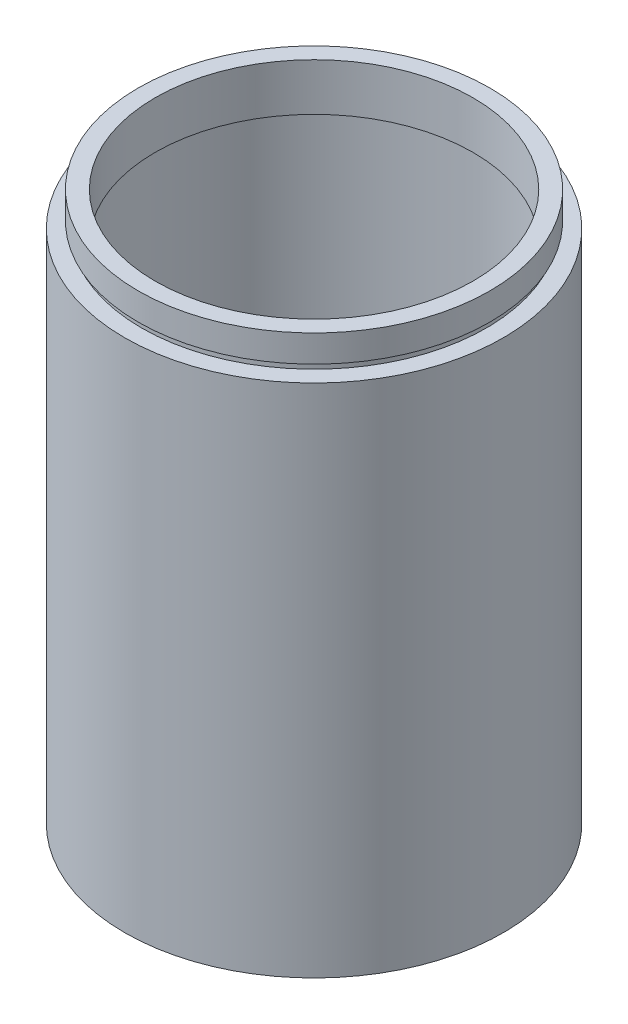
ISO-10303-21;
HEADER;
FILE_DESCRIPTION(('STEP AP214'),'2;1');
FILE_NAME('part.step','',(''),(''),'','','');
FILE_SCHEMA(('AUTOMOTIVE_DESIGN { 1 0 10303 214 1 1 1 1 }'));
ENDSEC;
DATA;
#1=APPLICATION_CONTEXT('core data for automotive mechanical design processes');
#2=APPLICATION_PROTOCOL_DEFINITION('international standard','automotive_design',2000,#1);
#3=PRODUCT_CONTEXT('',#1,'mechanical');
#4=PRODUCT('Part','Part','',(#3));
#5=PRODUCT_RELATED_PRODUCT_CATEGORY('part','',(#4));
#6=PRODUCT_DEFINITION_FORMATION('','',#4);
#7=PRODUCT_DEFINITION_CONTEXT('part definition',#1,'design');
#8=PRODUCT_DEFINITION('design','',#6,#7);
#9=PRODUCT_DEFINITION_SHAPE('','',#8);
#10=(LENGTH_UNIT() NAMED_UNIT(*) SI_UNIT(.MILLI.,.METRE.));
#11=(NAMED_UNIT(*) PLANE_ANGLE_UNIT() SI_UNIT($,.RADIAN.));
#12=(NAMED_UNIT(*) SI_UNIT($,.STERADIAN.) SOLID_ANGLE_UNIT());
#13=UNCERTAINTY_MEASURE_WITH_UNIT(LENGTH_MEASURE(1.E-05),#10,'distance_accuracy_value','');
#14=(GEOMETRIC_REPRESENTATION_CONTEXT(3) GLOBAL_UNCERTAINTY_ASSIGNED_CONTEXT((#13)) GLOBAL_UNIT_ASSIGNED_CONTEXT((#10,
#11,#12)) REPRESENTATION_CONTEXT('',''));
#15=CARTESIAN_POINT('',(0.,0.,0.));
#16=DIRECTION('',(0.,0.,1.));
#17=DIRECTION('',(1.,0.,0.));
#18=AXIS2_PLACEMENT_3D('',#15,#16,#17);
#19=CARTESIAN_POINT('',(0.,161.376166943427,0.));
#20=DIRECTION('',(0.,1.,0.));
#21=DIRECTION('',(0.,0.,1.));
#22=AXIS2_PLACEMENT_3D('',#19,#20,#21);
#23=CYLINDRICAL_SURFACE('',#22,23.5);
#24=CARTESIAN_POINT('',(0.,74.2,0.));
#25=DIRECTION('',(0.,1.,0.));
#26=DIRECTION('',(0.,0.,1.));
#27=AXIS2_PLACEMENT_3D('',#24,#25,#26);
#28=CIRCLE('',#27,23.5);
#29=CARTESIAN_POINT('',(0.,74.2,23.5));
#30=VERTEX_POINT('',#29);
#31=EDGE_CURVE('E77',#30,#30,#28,.T.);
#32=ORIENTED_EDGE('',*,*,#31,.F.);
#33=EDGE_LOOP('',(#32));
#34=FACE_BOUND('',#33,.T.);
#35=CARTESIAN_POINT('',(0.,81.2,0.));
#36=DIRECTION('',(0.,1.,0.));
#37=DIRECTION('',(0.,0.,1.));
#38=AXIS2_PLACEMENT_3D('',#35,#36,#37);
#39=CIRCLE('',#38,23.5);
#40=CARTESIAN_POINT('',(0.,81.2,23.5));
#41=VERTEX_POINT('',#40);
#42=EDGE_CURVE('E10',#41,#41,#39,.T.);
#43=ORIENTED_EDGE('',*,*,#42,.T.);
#44=EDGE_LOOP('',(#43));
#45=FACE_BOUND('',#44,.T.);
#46=ADVANCED_FACE('F37',(#34,#45),#23,.F.);
#47=CARTESIAN_POINT('',(23.5,81.2,0.));
#48=DIRECTION('',(0.,-1.,0.));
#49=DIRECTION('',(0.,0.,-1.));
#50=AXIS2_PLACEMENT_3D('',#47,#48,#49);
#51=PLANE('',#50);
#52=ORIENTED_EDGE('',*,*,#42,.F.);
#53=EDGE_LOOP('',(#52));
#54=FACE_BOUND('',#53,.T.);
#55=CARTESIAN_POINT('',(0.,81.2,0.));
#56=DIRECTION('',(0.,1.,0.));
#57=DIRECTION('',(0.,0.,1.));
#58=AXIS2_PLACEMENT_3D('',#55,#56,#57);
#59=CIRCLE('',#58,26.);
#60=CARTESIAN_POINT('',(0.,81.2,26.));
#61=VERTEX_POINT('',#60);
#62=EDGE_CURVE('E43',#61,#61,#59,.T.);
#63=ORIENTED_EDGE('',*,*,#62,.T.);
#64=EDGE_LOOP('',(#63));
#65=FACE_BOUND('',#64,.T.);
#66=ADVANCED_FACE('F84',(#54,#65),#51,.F.);
#67=CARTESIAN_POINT('',(0.,161.376166943427,0.));
#68=DIRECTION('',(0.,1.,0.));
#69=DIRECTION('',(0.,0.,1.));
#70=AXIS2_PLACEMENT_3D('',#67,#68,#69);
#71=CYLINDRICAL_SURFACE('',#70,26.);
#72=ORIENTED_EDGE('',*,*,#62,.F.);
#73=EDGE_LOOP('',(#72));
#74=FACE_BOUND('',#73,.T.);
#75=CARTESIAN_POINT('',(0.,77.2,0.));
#76=DIRECTION('',(0.,1.,0.));
#77=DIRECTION('',(0.,0.,1.));
#78=AXIS2_PLACEMENT_3D('',#75,#76,#77);
#79=CIRCLE('',#78,26.);
#80=CARTESIAN_POINT('',(0.,77.2,26.));
#81=VERTEX_POINT('',#80);
#82=EDGE_CURVE('E47',#81,#81,#79,.T.);
#83=ORIENTED_EDGE('',*,*,#82,.T.);
#84=EDGE_LOOP('',(#83));
#85=FACE_BOUND('',#84,.T.);
#86=ADVANCED_FACE('F88',(#74,#85),#71,.T.);
#87=CARTESIAN_POINT('',(26.,77.2,0.));
#88=DIRECTION('',(0.,1.,0.));
#89=DIRECTION('',(0.,0.,1.));
#90=AXIS2_PLACEMENT_3D('',#87,#88,#89);
#91=PLANE('',#90);
#92=ORIENTED_EDGE('',*,*,#82,.F.);
#93=EDGE_LOOP('',(#92));
#94=FACE_BOUND('',#93,.T.);
#95=CARTESIAN_POINT('',(0.,77.2,0.));
#96=DIRECTION('',(0.,1.,0.));
#97=DIRECTION('',(0.,0.,1.));
#98=AXIS2_PLACEMENT_3D('',#95,#96,#97);
#99=CIRCLE('',#98,25.5);
#100=CARTESIAN_POINT('',(0.,77.2,25.5));
#101=VERTEX_POINT('',#100);
#102=EDGE_CURVE('E51',#101,#101,#99,.T.);
#103=ORIENTED_EDGE('',*,*,#102,.T.);
#104=EDGE_LOOP('',(#103));
#105=FACE_BOUND('',#104,.T.);
#106=ADVANCED_FACE('F93',(#94,#105),#91,.F.);
#107=CARTESIAN_POINT('',(0.,161.376166943427,0.));
#108=DIRECTION('',(0.,1.,0.));
#109=DIRECTION('',(0.,0.,1.));
#110=AXIS2_PLACEMENT_3D('',#107,#108,#109);
#111=CYLINDRICAL_SURFACE('',#110,25.5);
#112=ORIENTED_EDGE('',*,*,#102,.F.);
#113=EDGE_LOOP('',(#112));
#114=FACE_BOUND('',#113,.T.);
#115=CARTESIAN_POINT('',(0.,76.2,0.));
#116=DIRECTION('',(0.,1.,0.));
#117=DIRECTION('',(0.,0.,1.));
#118=AXIS2_PLACEMENT_3D('',#115,#116,#117);
#119=CIRCLE('',#118,25.5);
#120=CARTESIAN_POINT('',(0.,76.2,25.5));
#121=VERTEX_POINT('',#120);
#122=EDGE_CURVE('E56',#121,#121,#119,.T.);
#123=ORIENTED_EDGE('',*,*,#122,.T.);
#124=EDGE_LOOP('',(#123));
#125=FACE_BOUND('',#124,.T.);
#126=ADVANCED_FACE('F99',(#114,#125),#111,.T.);
#127=CARTESIAN_POINT('',(25.5,76.2,0.));
#128=DIRECTION('',(0.,-1.,0.));
#129=DIRECTION('',(0.,0.,-1.));
#130=AXIS2_PLACEMENT_3D('',#127,#128,#129);
#131=PLANE('',#130);
#132=ORIENTED_EDGE('',*,*,#122,.F.);
#133=EDGE_LOOP('',(#132));
#134=FACE_BOUND('',#133,.T.);
#135=CARTESIAN_POINT('',(0.,76.2,0.));
#136=DIRECTION('',(0.,1.,0.));
#137=DIRECTION('',(0.,0.,1.));
#138=AXIS2_PLACEMENT_3D('',#135,#136,#137);
#139=CIRCLE('',#138,28.);
#140=CARTESIAN_POINT('',(0.,76.2,28.));
#141=VERTEX_POINT('',#140);
#142=EDGE_CURVE('E59',#141,#141,#139,.T.);
#143=ORIENTED_EDGE('',*,*,#142,.T.);
#144=EDGE_LOOP('',(#143));
#145=FACE_BOUND('',#144,.T.);
#146=ADVANCED_FACE('F103',(#134,#145),#131,.F.);
#147=CARTESIAN_POINT('',(0.,161.376166943427,0.));
#148=DIRECTION('',(0.,1.,0.));
#149=DIRECTION('',(0.,0.,1.));
#150=AXIS2_PLACEMENT_3D('',#147,#148,#149);
#151=CYLINDRICAL_SURFACE('',#150,28.);
#152=ORIENTED_EDGE('',*,*,#142,.F.);
#153=EDGE_LOOP('',(#152));
#154=FACE_BOUND('',#153,.T.);
#155=CARTESIAN_POINT('',(0.,0.,0.));
#156=DIRECTION('',(0.,1.,0.));
#157=DIRECTION('',(0.,0.,1.));
#158=AXIS2_PLACEMENT_3D('',#155,#156,#157);
#159=CIRCLE('',#158,28.);
#160=CARTESIAN_POINT('',(0.,0.,28.));
#161=VERTEX_POINT('',#160);
#162=EDGE_CURVE('E62',#161,#161,#159,.T.);
#163=ORIENTED_EDGE('',*,*,#162,.T.);
#164=EDGE_LOOP('',(#163));
#165=FACE_BOUND('',#164,.T.);
#166=ADVANCED_FACE('F107',(#154,#165),#151,.T.);
#167=CARTESIAN_POINT('',(28.,0.,0.));
#168=DIRECTION('',(0.,1.,0.));
#169=DIRECTION('',(0.,0.,1.));
#170=AXIS2_PLACEMENT_3D('',#167,#168,#169);
#171=PLANE('',#170);
#172=ORIENTED_EDGE('',*,*,#162,.F.);
#173=EDGE_LOOP('',(#172));
#174=FACE_BOUND('',#173,.T.);
#175=CARTESIAN_POINT('',(0.,0.,0.));
#176=DIRECTION('',(0.,1.,0.));
#177=DIRECTION('',(0.,0.,1.));
#178=AXIS2_PLACEMENT_3D('',#175,#176,#177);
#179=CIRCLE('',#178,25.5);
#180=CARTESIAN_POINT('',(0.,0.,25.5));
#181=VERTEX_POINT('',#180);
#182=EDGE_CURVE('E65',#181,#181,#179,.T.);
#183=ORIENTED_EDGE('',*,*,#182,.T.);
#184=EDGE_LOOP('',(#183));
#185=FACE_BOUND('',#184,.T.);
#186=ADVANCED_FACE('F111',(#174,#185),#171,.F.);
#187=CARTESIAN_POINT('',(0.,161.376166943427,0.));
#188=DIRECTION('',(0.,1.,0.));
#189=DIRECTION('',(0.,0.,1.));
#190=AXIS2_PLACEMENT_3D('',#187,#188,#189);
#191=CYLINDRICAL_SURFACE('',#190,25.5);
#192=ORIENTED_EDGE('',*,*,#182,.F.);
#193=EDGE_LOOP('',(#192));
#194=FACE_BOUND('',#193,.T.);
#195=CARTESIAN_POINT('',(0.,73.2,0.));
#196=DIRECTION('',(0.,1.,0.));
#197=DIRECTION('',(0.,0.,1.));
#198=AXIS2_PLACEMENT_3D('',#195,#196,#197);
#199=CIRCLE('',#198,25.5);
#200=CARTESIAN_POINT('',(0.,73.2,25.5));
#201=VERTEX_POINT('',#200);
#202=EDGE_CURVE('E68',#201,#201,#199,.T.);
#203=ORIENTED_EDGE('',*,*,#202,.T.);
#204=EDGE_LOOP('',(#203));
#205=FACE_BOUND('',#204,.T.);
#206=ADVANCED_FACE('F115',(#194,#205),#191,.F.);
#207=CARTESIAN_POINT('',(25.5,73.2,0.));
#208=DIRECTION('',(0.,-1.,0.));
#209=DIRECTION('',(0.,0.,-1.));
#210=AXIS2_PLACEMENT_3D('',#207,#208,#209);
#211=PLANE('',#210);
#212=ORIENTED_EDGE('',*,*,#202,.F.);
#213=EDGE_LOOP('',(#212));
#214=FACE_BOUND('',#213,.T.);
#215=CARTESIAN_POINT('',(0.,73.2,0.));
#216=DIRECTION('',(0.,1.,0.));
#217=DIRECTION('',(0.,0.,1.));
#218=AXIS2_PLACEMENT_3D('',#215,#216,#217);
#219=CIRCLE('',#218,26.1);
#220=CARTESIAN_POINT('',(0.,73.2,26.1));
#221=VERTEX_POINT('',#220);
#222=EDGE_CURVE('E71',#221,#221,#219,.T.);
#223=ORIENTED_EDGE('',*,*,#222,.T.);
#224=EDGE_LOOP('',(#223));
#225=FACE_BOUND('',#224,.T.);
#226=ADVANCED_FACE('F119',(#214,#225),#211,.F.);
#227=CARTESIAN_POINT('',(0.,161.376166943427,0.));
#228=DIRECTION('',(0.,1.,0.));
#229=DIRECTION('',(0.,0.,1.));
#230=AXIS2_PLACEMENT_3D('',#227,#228,#229);
#231=CYLINDRICAL_SURFACE('',#230,26.1);
#232=ORIENTED_EDGE('',*,*,#222,.F.);
#233=EDGE_LOOP('',(#232));
#234=FACE_BOUND('',#233,.T.);
#235=CARTESIAN_POINT('',(0.,74.2,0.));
#236=DIRECTION('',(0.,1.,0.));
#237=DIRECTION('',(0.,0.,1.));
#238=AXIS2_PLACEMENT_3D('',#235,#236,#237);
#239=CIRCLE('',#238,26.1);
#240=CARTESIAN_POINT('',(0.,74.2,26.1));
#241=VERTEX_POINT('',#240);
#242=EDGE_CURVE('E74',#241,#241,#239,.T.);
#243=ORIENTED_EDGE('',*,*,#242,.T.);
#244=EDGE_LOOP('',(#243));
#245=FACE_BOUND('',#244,.T.);
#246=ADVANCED_FACE('F123',(#234,#245),#231,.F.);
#247=CARTESIAN_POINT('',(26.1,74.2,0.));
#248=DIRECTION('',(0.,1.,0.));
#249=DIRECTION('',(0.,0.,1.));
#250=AXIS2_PLACEMENT_3D('',#247,#248,#249);
#251=PLANE('',#250);
#252=ORIENTED_EDGE('',*,*,#242,.F.);
#253=EDGE_LOOP('',(#252));
#254=FACE_BOUND('',#253,.T.);
#255=ORIENTED_EDGE('',*,*,#31,.T.);
#256=EDGE_LOOP('',(#255));
#257=FACE_BOUND('',#256,.T.);
#258=ADVANCED_FACE('F81',(#254,#257),#251,.F.);
#259=CLOSED_SHELL('',(#46,#66,#86,#106,#126,#146,#166,#186,#206,#226,#246,#258));
#260=MANIFOLD_SOLID_BREP('B2',#259);
#261=ADVANCED_BREP_SHAPE_REPRESENTATION('',(#18,#260),#14);
#262=SHAPE_DEFINITION_REPRESENTATION(#9,#261);
ENDSEC;
END-ISO-10303-21;
